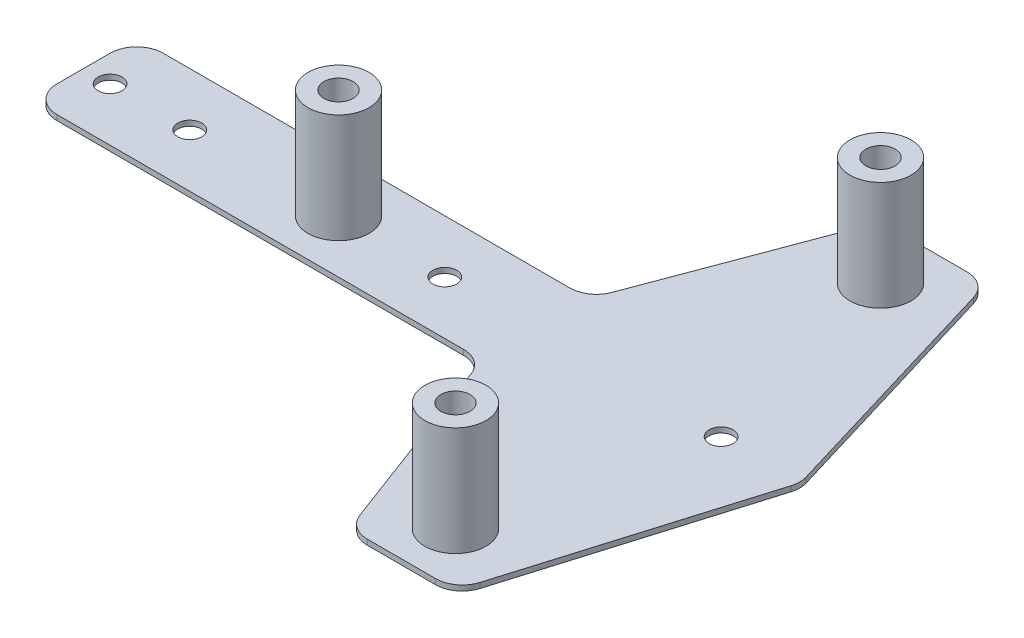
ISO-10303-21;
HEADER;
FILE_DESCRIPTION(('STEP AP214'),'2;1');
FILE_NAME('part.step','',(''),(''),'','','');
FILE_SCHEMA(('AUTOMOTIVE_DESIGN { 1 0 10303 214 1 1 1 1 }'));
ENDSEC;
DATA;
#1=APPLICATION_CONTEXT('core data for automotive mechanical design processes');
#2=APPLICATION_PROTOCOL_DEFINITION('international standard','automotive_design',2000,#1);
#3=PRODUCT_CONTEXT('',#1,'mechanical');
#4=PRODUCT('Part','Part','',(#3));
#5=PRODUCT_RELATED_PRODUCT_CATEGORY('part','',(#4));
#6=PRODUCT_DEFINITION_FORMATION('','',#4);
#7=PRODUCT_DEFINITION_CONTEXT('part definition',#1,'design');
#8=PRODUCT_DEFINITION('design','',#6,#7);
#9=PRODUCT_DEFINITION_SHAPE('','',#8);
#10=(LENGTH_UNIT() NAMED_UNIT(*) SI_UNIT(.MILLI.,.METRE.));
#11=(NAMED_UNIT(*) PLANE_ANGLE_UNIT() SI_UNIT($,.RADIAN.));
#12=(NAMED_UNIT(*) SI_UNIT($,.STERADIAN.) SOLID_ANGLE_UNIT());
#13=UNCERTAINTY_MEASURE_WITH_UNIT(LENGTH_MEASURE(1.E-05),#10,'distance_accuracy_value','');
#14=(GEOMETRIC_REPRESENTATION_CONTEXT(3) GLOBAL_UNCERTAINTY_ASSIGNED_CONTEXT((#13)) GLOBAL_UNIT_ASSIGNED_CONTEXT((#10,
#11,#12)) REPRESENTATION_CONTEXT('',''));
#15=CARTESIAN_POINT('',(0.,0.,0.));
#16=DIRECTION('',(0.,0.,1.));
#17=DIRECTION('',(1.,0.,0.));
#18=AXIS2_PLACEMENT_3D('',#15,#16,#17);
#19=CARTESIAN_POINT('',(-55.,0.,0.));
#20=DIRECTION('',(0.,1.,0.));
#21=DIRECTION('',(0.,0.,1.));
#22=AXIS2_PLACEMENT_3D('',#19,#20,#21);
#23=CYLINDRICAL_SURFACE('',#22,2.25);
#24=CARTESIAN_POINT('',(-55.,0.,0.));
#25=DIRECTION('',(0.,1.,0.));
#26=DIRECTION('',(0.,0.,1.));
#27=AXIS2_PLACEMENT_3D('',#24,#25,#26);
#28=CIRCLE('',#27,2.25);
#29=CARTESIAN_POINT('',(-55.,0.,2.25));
#30=VERTEX_POINT('',#29);
#31=EDGE_CURVE('E436',#30,#30,#28,.T.);
#32=ORIENTED_EDGE('',*,*,#31,.F.);
#33=EDGE_LOOP('',(#32));
#34=FACE_BOUND('',#33,.T.);
#35=CARTESIAN_POINT('',(-55.,1.,0.));
#36=DIRECTION('',(0.,1.,0.));
#37=DIRECTION('',(0.,0.,1.));
#38=AXIS2_PLACEMENT_3D('',#35,#36,#37);
#39=CIRCLE('',#38,2.25);
#40=CARTESIAN_POINT('',(-55.,1.,2.25));
#41=VERTEX_POINT('',#40);
#42=EDGE_CURVE('E439',#41,#41,#39,.T.);
#43=ORIENTED_EDGE('',*,*,#42,.T.);
#44=EDGE_LOOP('',(#43));
#45=FACE_BOUND('',#44,.T.);
#46=ADVANCED_FACE('F39',(#34,#45),#23,.F.);
#47=CARTESIAN_POINT('',(6.53499765917655,1.,-15.));
#48=DIRECTION('',(0.,1.,0.));
#49=DIRECTION('',(0.,0.,1.));
#50=AXIS2_PLACEMENT_3D('',#47,#48,#49);
#51=PLANE('',#50);
#52=ORIENTED_EDGE('',*,*,#42,.F.);
#53=EDGE_LOOP('',(#52));
#54=FACE_BOUND('',#53,.T.);
#55=DIRECTION('',(-1.,0.,0.));
#56=VECTOR('',#55,1.);
#57=CARTESIAN_POINT('',(-55.,1.,-10.));
#58=LINE('',#57,#56);
#59=CARTESIAN_POINT('',(6.53499765917655,1.,-10.));
#60=VERTEX_POINT('',#59);
#61=CARTESIAN_POINT('',(-70.,1.,-10.));
#62=VERTEX_POINT('',#61);
#63=EDGE_CURVE('E118',#60,#62,#58,.T.);
#64=ORIENTED_EDGE('',*,*,#63,.T.);
#65=CARTESIAN_POINT('',(-70.,1.,-5.00000000000001));
#66=DIRECTION('',(0.,1.,0.));
#67=DIRECTION('',(0.,0.,1.));
#68=AXIS2_PLACEMENT_3D('',#65,#66,#67);
#69=CIRCLE('',#68,5.);
#70=CARTESIAN_POINT('',(-75.,1.,-4.99999999999997));
#71=VERTEX_POINT('',#70);
#72=EDGE_CURVE('E474',#62,#71,#69,.T.);
#73=ORIENTED_EDGE('',*,*,#72,.T.);
#74=DIRECTION('',(0.,0.,1.));
#75=VECTOR('',#74,1.);
#76=CARTESIAN_POINT('',(-75.,1.,-4.99999999999997));
#77=LINE('',#76,#75);
#78=CARTESIAN_POINT('',(-75.,1.,4.99999999999997));
#79=VERTEX_POINT('',#78);
#80=EDGE_CURVE('E479',#71,#79,#77,.T.);
#81=ORIENTED_EDGE('',*,*,#80,.T.);
#82=CARTESIAN_POINT('',(-70.,1.,5.));
#83=DIRECTION('',(0.,1.,0.));
#84=DIRECTION('',(0.,0.,1.));
#85=AXIS2_PLACEMENT_3D('',#82,#83,#84);
#86=CIRCLE('',#85,5.);
#87=CARTESIAN_POINT('',(-70.,1.,10.));
#88=VERTEX_POINT('',#87);
#89=EDGE_CURVE('E408',#79,#88,#86,.T.);
#90=ORIENTED_EDGE('',*,*,#89,.T.);
#91=DIRECTION('',(1.,0.,0.));
#92=VECTOR('',#91,1.);
#93=CARTESIAN_POINT('',(6.53499765917655,1.,10.));
#94=LINE('',#93,#92);
#95=CARTESIAN_POINT('',(6.53499765917655,1.,10.));
#96=VERTEX_POINT('',#95);
#97=EDGE_CURVE('E404',#88,#96,#94,.T.);
#98=ORIENTED_EDGE('',*,*,#97,.T.);
#99=CARTESIAN_POINT('',(6.53499765917655,1.,15.));
#100=DIRECTION('',(0.,-1.,0.));
#101=DIRECTION('',(0.,0.,1.));
#102=AXIS2_PLACEMENT_3D('',#99,#100,#101);
#103=CIRCLE('',#102,5.);
#104=CARTESIAN_POINT('',(11.2166435470218,1.,13.244382792058));
#105=VERTEX_POINT('',#104);
#106=EDGE_CURVE('E241',#96,#105,#103,.T.);
#107=ORIENTED_EDGE('',*,*,#106,.T.);
#108=DIRECTION('',(0.351123441588391,0.,0.936329177569045));
#109=VECTOR('',#108,1.);
#110=CARTESIAN_POINT('',(23.7833564529782,1.,46.755617207942));
#111=LINE('',#110,#109);
#112=CARTESIAN_POINT('',(23.7833564529782,1.,46.755617207942));
#113=VERTEX_POINT('',#112);
#114=EDGE_CURVE('E266',#105,#113,#111,.T.);
#115=ORIENTED_EDGE('',*,*,#114,.T.);
#116=CARTESIAN_POINT('',(28.4650023408235,1.,45.));
#117=DIRECTION('',(0.,1.,0.));
#118=DIRECTION('',(0.,0.,-1.));
#119=AXIS2_PLACEMENT_3D('',#116,#117,#118);
#120=CIRCLE('',#119,4.99999999999999);
#121=CARTESIAN_POINT('',(28.4650023408235,1.,50.));
#122=VERTEX_POINT('',#121);
#123=EDGE_CURVE('E263',#113,#122,#120,.T.);
#124=ORIENTED_EDGE('',*,*,#123,.T.);
#125=DIRECTION('',(1.,0.,0.));
#126=VECTOR('',#125,1.);
#127=CARTESIAN_POINT('',(41.2798467455448,1.,50.));
#128=LINE('',#127,#126);
#129=CARTESIAN_POINT('',(41.2798467455448,1.,50.));
#130=VERTEX_POINT('',#129);
#131=EDGE_CURVE('E265',#122,#130,#128,.T.);
#132=ORIENTED_EDGE('',*,*,#131,.T.);
#133=CARTESIAN_POINT('',(41.2798467455448,1.,45.));
#134=DIRECTION('',(0.,1.,0.));
#135=DIRECTION('',(0.,0.,-1.));
#136=AXIS2_PLACEMENT_3D('',#133,#134,#135);
#137=CIRCLE('',#136,4.99999999999999);
#138=CARTESIAN_POINT('',(46.0689781716505,1.,46.4367394278317));
#139=VERTEX_POINT('',#138);
#140=EDGE_CURVE('E268',#130,#139,#137,.T.);
#141=ORIENTED_EDGE('',*,*,#140,.T.);
#142=DIRECTION('',(0.287347885566344,0.,-0.957826285221152));
#143=VECTOR('',#142,1.);
#144=CARTESIAN_POINT('',(59.5689781716505,1.,1.43673942783172));
#145=LINE('',#144,#143);
#146=CARTESIAN_POINT('',(59.5689781716505,1.,1.43673942783172));
#147=VERTEX_POINT('',#146);
#148=EDGE_CURVE('E274',#139,#147,#145,.T.);
#149=ORIENTED_EDGE('',*,*,#148,.T.);
#150=CARTESIAN_POINT('',(54.7798467455447,1.,0.));
#151=DIRECTION('',(0.,1.,0.));
#152=DIRECTION('',(0.,0.,-1.));
#153=AXIS2_PLACEMENT_3D('',#150,#151,#152);
#154=CIRCLE('',#153,5.00000000000001);
#155=CARTESIAN_POINT('',(59.5689781716505,1.,-1.43673942783172));
#156=VERTEX_POINT('',#155);
#157=EDGE_CURVE('E276',#147,#156,#154,.T.);
#158=ORIENTED_EDGE('',*,*,#157,.T.);
#159=DIRECTION('',(-0.287347885566344,0.,-0.957826285221152));
#160=VECTOR('',#159,1.);
#161=CARTESIAN_POINT('',(46.0689781716505,1.,-46.4367394278317));
#162=LINE('',#161,#160);
#163=CARTESIAN_POINT('',(46.0689781716505,1.,-46.4367394278317));
#164=VERTEX_POINT('',#163);
#165=EDGE_CURVE('E278',#156,#164,#162,.T.);
#166=ORIENTED_EDGE('',*,*,#165,.T.);
#167=CARTESIAN_POINT('',(41.2798467455448,1.,-45.));
#168=DIRECTION('',(0.,1.,0.));
#169=DIRECTION('',(0.,0.,-1.));
#170=AXIS2_PLACEMENT_3D('',#167,#168,#169);
#171=CIRCLE('',#170,4.99999999999999);
#172=CARTESIAN_POINT('',(41.2798467455448,1.,-50.));
#173=VERTEX_POINT('',#172);
#174=EDGE_CURVE('E159',#164,#173,#171,.T.);
#175=ORIENTED_EDGE('',*,*,#174,.T.);
#176=DIRECTION('',(-1.,0.,0.));
#177=VECTOR('',#176,1.);
#178=CARTESIAN_POINT('',(28.4650023408235,1.,-50.));
#179=LINE('',#178,#177);
#180=CARTESIAN_POINT('',(28.4650023408235,1.,-50.));
#181=VERTEX_POINT('',#180);
#182=EDGE_CURVE('E152',#173,#181,#179,.T.);
#183=ORIENTED_EDGE('',*,*,#182,.T.);
#184=CARTESIAN_POINT('',(28.4650023408235,1.,-45.));
#185=DIRECTION('',(0.,1.,0.));
#186=DIRECTION('',(0.,0.,-1.));
#187=AXIS2_PLACEMENT_3D('',#184,#185,#186);
#188=CIRCLE('',#187,4.99999999999999);
#189=CARTESIAN_POINT('',(23.7833564529782,1.,-46.755617207942));
#190=VERTEX_POINT('',#189);
#191=EDGE_CURVE('E157',#181,#190,#188,.T.);
#192=ORIENTED_EDGE('',*,*,#191,.T.);
#193=DIRECTION('',(-0.351123441588391,0.,0.936329177569045));
#194=VECTOR('',#193,1.);
#195=CARTESIAN_POINT('',(11.2166435470218,1.,-13.244382792058));
#196=LINE('',#195,#194);
#197=CARTESIAN_POINT('',(11.2166435470218,1.,-13.244382792058));
#198=VERTEX_POINT('',#197);
#199=EDGE_CURVE('E56',#190,#198,#196,.T.);
#200=ORIENTED_EDGE('',*,*,#199,.T.);
#201=CARTESIAN_POINT('',(6.53499765917655,1.,-15.));
#202=DIRECTION('',(0.,-1.,0.));
#203=DIRECTION('',(0.,0.,1.));
#204=AXIS2_PLACEMENT_3D('',#201,#202,#203);
#205=CIRCLE('',#204,5.);
#206=EDGE_CURVE('E207',#198,#60,#205,.T.);
#207=ORIENTED_EDGE('',*,*,#206,.T.);
#208=EDGE_LOOP('',(#64,#73,#81,#90,#98,#107,#115,#124,#132,#141,#149,#158,#166,#175,#183,#192,
#200,#207));
#209=FACE_BOUND('',#208,.T.);
#210=CARTESIAN_POINT('',(-70.,1.,0.));
#211=DIRECTION('',(0.,1.,0.));
#212=DIRECTION('',(0.,0.,1.));
#213=AXIS2_PLACEMENT_3D('',#210,#211,#212);
#214=CIRCLE('',#213,2.25);
#215=CARTESIAN_POINT('',(-70.,1.,2.24999999999999));
#216=VERTEX_POINT('',#215);
#217=EDGE_CURVE('E433',#216,#216,#214,.T.);
#218=ORIENTED_EDGE('',*,*,#217,.F.);
#219=EDGE_LOOP('',(#218));
#220=FACE_BOUND('',#219,.T.);
#221=CARTESIAN_POINT('',(45.,1.,0.));
#222=DIRECTION('',(0.,1.,0.));
#223=DIRECTION('',(0.,0.,1.));
#224=AXIS2_PLACEMENT_3D('',#221,#222,#223);
#225=CIRCLE('',#224,2.25);
#226=CARTESIAN_POINT('',(45.,1.,2.25));
#227=VERTEX_POINT('',#226);
#228=EDGE_CURVE('E442',#227,#227,#225,.T.);
#229=ORIENTED_EDGE('',*,*,#228,.F.);
#230=EDGE_LOOP('',(#229));
#231=FACE_BOUND('',#230,.T.);
#232=CARTESIAN_POINT('',(-7.,1.,0.));
#233=DIRECTION('',(0.,1.,0.));
#234=DIRECTION('',(0.,0.,1.));
#235=AXIS2_PLACEMENT_3D('',#232,#233,#234);
#236=CIRCLE('',#235,2.25);
#237=CARTESIAN_POINT('',(-7.,1.,2.25));
#238=VERTEX_POINT('',#237);
#239=EDGE_CURVE('E448',#238,#238,#236,.T.);
#240=ORIENTED_EDGE('',*,*,#239,.F.);
#241=EDGE_LOOP('',(#240));
#242=FACE_BOUND('',#241,.T.);
#243=CARTESIAN_POINT('',(35.,1.,-40.));
#244=DIRECTION('',(0.,1.,0.));
#245=DIRECTION('',(0.,0.,1.));
#246=AXIS2_PLACEMENT_3D('',#243,#244,#245);
#247=CIRCLE('',#246,5.74999999999999);
#248=CARTESIAN_POINT('',(35.,1.,-34.25));
#249=VERTEX_POINT('',#248);
#250=EDGE_CURVE('E375',#249,#249,#247,.T.);
#251=ORIENTED_EDGE('',*,*,#250,.F.);
#252=EDGE_LOOP('',(#251));
#253=FACE_BOUND('',#252,.T.);
#254=CARTESIAN_POINT('',(-27.,1.,0.));
#255=DIRECTION('',(0.,1.,0.));
#256=DIRECTION('',(0.,0.,1.));
#257=AXIS2_PLACEMENT_3D('',#254,#255,#256);
#258=CIRCLE('',#257,5.75);
#259=CARTESIAN_POINT('',(-27.,1.,5.75));
#260=VERTEX_POINT('',#259);
#261=EDGE_CURVE('E390',#260,#260,#258,.T.);
#262=ORIENTED_EDGE('',*,*,#261,.F.);
#263=EDGE_LOOP('',(#262));
#264=FACE_BOUND('',#263,.T.);
#265=CARTESIAN_POINT('',(35.,1.,40.));
#266=DIRECTION('',(0.,1.,0.));
#267=DIRECTION('',(0.,0.,1.));
#268=AXIS2_PLACEMENT_3D('',#265,#266,#267);
#269=CIRCLE('',#268,5.74999999999999);
#270=CARTESIAN_POINT('',(35.,1.,45.75));
#271=VERTEX_POINT('',#270);
#272=EDGE_CURVE('E372',#271,#271,#269,.T.);
#273=ORIENTED_EDGE('',*,*,#272,.F.);
#274=EDGE_LOOP('',(#273));
#275=FACE_BOUND('',#274,.T.);
#276=ADVANCED_FACE('F154',(#54,#209,#220,#231,#242,#253,#264,#275),#51,.T.);
#277=CARTESIAN_POINT('',(6.53499765917655,1.,-15.));
#278=DIRECTION('',(0.,-1.,0.));
#279=DIRECTION('',(0.,0.,-1.));
#280=AXIS2_PLACEMENT_3D('',#277,#278,#279);
#281=CYLINDRICAL_SURFACE('',#280,5.);
#282=CARTESIAN_POINT('',(6.53499765917655,0.,-15.));
#283=DIRECTION('',(0.,-1.,0.));
#284=DIRECTION('',(0.,0.,1.));
#285=AXIS2_PLACEMENT_3D('',#282,#283,#284);
#286=CIRCLE('',#285,5.);
#287=CARTESIAN_POINT('',(11.2166435470218,0.,-13.244382792058));
#288=VERTEX_POINT('',#287);
#289=CARTESIAN_POINT('',(6.53499765917655,0.,-10.));
#290=VERTEX_POINT('',#289);
#291=EDGE_CURVE('E177',#288,#290,#286,.T.);
#292=ORIENTED_EDGE('',*,*,#291,.T.);
#293=DIRECTION('',(0.,-1.,0.));
#294=VECTOR('',#293,1.);
#295=CARTESIAN_POINT('',(6.53499765917655,1.,-10.));
#296=LINE('',#295,#294);
#297=EDGE_CURVE('E11',#60,#290,#296,.T.);
#298=ORIENTED_EDGE('',*,*,#297,.F.);
#299=ORIENTED_EDGE('',*,*,#206,.F.);
#300=DIRECTION('',(0.,-1.,0.));
#301=VECTOR('',#300,1.);
#302=CARTESIAN_POINT('',(11.2166435470218,1.,-13.244382792058));
#303=LINE('',#302,#301);
#304=EDGE_CURVE('E173',#198,#288,#303,.T.);
#305=ORIENTED_EDGE('',*,*,#304,.T.);
#306=EDGE_LOOP('',(#292,#298,#299,#305));
#307=FACE_BOUND('',#306,.T.);
#308=ADVANCED_FACE('F41',(#307),#281,.F.);
#309=CARTESIAN_POINT('',(-55.,1.,-10.));
#310=DIRECTION('',(0.,0.,1.));
#311=DIRECTION('',(1.,0.,0.));
#312=AXIS2_PLACEMENT_3D('',#309,#310,#311);
#313=PLANE('',#312);
#314=DIRECTION('',(-1.,0.,0.));
#315=VECTOR('',#314,1.);
#316=CARTESIAN_POINT('',(-55.,0.,-10.));
#317=LINE('',#316,#315);
#318=CARTESIAN_POINT('',(-70.,0.,-10.));
#319=VERTEX_POINT('',#318);
#320=EDGE_CURVE('E180',#290,#319,#317,.T.);
#321=ORIENTED_EDGE('',*,*,#320,.T.);
#322=DIRECTION('',(0.,-1.,0.));
#323=VECTOR('',#322,1.);
#324=CARTESIAN_POINT('',(-70.,29.2842712474619,-10.));
#325=LINE('',#324,#323);
#326=EDGE_CURVE('E429',#62,#319,#325,.T.);
#327=ORIENTED_EDGE('',*,*,#326,.F.);
#328=ORIENTED_EDGE('',*,*,#63,.F.);
#329=ORIENTED_EDGE('',*,*,#297,.T.);
#330=EDGE_LOOP('',(#321,#327,#328,#329));
#331=FACE_BOUND('',#330,.T.);
#332=ADVANCED_FACE('F500',(#331),#313,.F.);
#333=CARTESIAN_POINT('',(6.53499765917655,1.,10.));
#334=DIRECTION('',(0.,0.,-1.));
#335=DIRECTION('',(-1.,0.,0.));
#336=AXIS2_PLACEMENT_3D('',#333,#334,#335);
#337=PLANE('',#336);
#338=DIRECTION('',(1.,0.,0.));
#339=VECTOR('',#338,1.);
#340=CARTESIAN_POINT('',(6.53499765917655,0.,10.));
#341=LINE('',#340,#339);
#342=CARTESIAN_POINT('',(-70.,0.,10.));
#343=VERTEX_POINT('',#342);
#344=CARTESIAN_POINT('',(6.53499765917655,0.,10.));
#345=VERTEX_POINT('',#344);
#346=EDGE_CURVE('E184',#343,#345,#341,.T.);
#347=ORIENTED_EDGE('',*,*,#346,.T.);
#348=DIRECTION('',(0.,-1.,0.));
#349=VECTOR('',#348,1.);
#350=CARTESIAN_POINT('',(6.53499765917655,1.,10.));
#351=LINE('',#350,#349);
#352=EDGE_CURVE('E48',#96,#345,#351,.T.);
#353=ORIENTED_EDGE('',*,*,#352,.F.);
#354=ORIENTED_EDGE('',*,*,#97,.F.);
#355=DIRECTION('',(0.,-1.,0.));
#356=VECTOR('',#355,1.);
#357=CARTESIAN_POINT('',(-70.,29.2842712474619,10.));
#358=LINE('',#357,#356);
#359=EDGE_CURVE('E411',#88,#343,#358,.T.);
#360=ORIENTED_EDGE('',*,*,#359,.T.);
#361=EDGE_LOOP('',(#347,#353,#354,#360));
#362=FACE_BOUND('',#361,.T.);
#363=ADVANCED_FACE('F410',(#362),#337,.F.);
#364=CARTESIAN_POINT('',(6.53499765917655,1.,15.));
#365=DIRECTION('',(0.,-1.,0.));
#366=DIRECTION('',(0.,0.,-1.));
#367=AXIS2_PLACEMENT_3D('',#364,#365,#366);
#368=CYLINDRICAL_SURFACE('',#367,5.);
#369=CARTESIAN_POINT('',(6.53499765917655,0.,15.));
#370=DIRECTION('',(0.,-1.,0.));
#371=DIRECTION('',(0.,0.,1.));
#372=AXIS2_PLACEMENT_3D('',#369,#370,#371);
#373=CIRCLE('',#372,5.);
#374=CARTESIAN_POINT('',(11.2166435470218,0.,13.244382792058));
#375=VERTEX_POINT('',#374);
#376=EDGE_CURVE('E186',#345,#375,#373,.T.);
#377=ORIENTED_EDGE('',*,*,#376,.T.);
#378=DIRECTION('',(0.,-1.,0.));
#379=VECTOR('',#378,1.);
#380=CARTESIAN_POINT('',(11.2166435470218,1.,13.244382792058));
#381=LINE('',#380,#379);
#382=EDGE_CURVE('E232',#105,#375,#381,.T.);
#383=ORIENTED_EDGE('',*,*,#382,.F.);
#384=ORIENTED_EDGE('',*,*,#106,.F.);
#385=ORIENTED_EDGE('',*,*,#352,.T.);
#386=EDGE_LOOP('',(#377,#383,#384,#385));
#387=FACE_BOUND('',#386,.T.);
#388=ADVANCED_FACE('F239',(#387),#368,.F.);
#389=CARTESIAN_POINT('',(23.7833564529782,1.,46.755617207942));
#390=DIRECTION('',(0.936329177569045,0.,-0.351123441588391));
#391=DIRECTION('',(-0.351123441588391,0.,-0.936329177569045));
#392=AXIS2_PLACEMENT_3D('',#389,#390,#391);
#393=PLANE('',#392);
#394=DIRECTION('',(0.351123441588391,0.,0.936329177569045));
#395=VECTOR('',#394,1.);
#396=CARTESIAN_POINT('',(23.7833564529782,0.,46.755617207942));
#397=LINE('',#396,#395);
#398=CARTESIAN_POINT('',(23.7833564529782,0.,46.755617207942));
#399=VERTEX_POINT('',#398);
#400=EDGE_CURVE('E188',#375,#399,#397,.T.);
#401=ORIENTED_EDGE('',*,*,#400,.T.);
#402=DIRECTION('',(0.,-1.,0.));
#403=VECTOR('',#402,1.);
#404=CARTESIAN_POINT('',(23.7833564529782,1.,46.755617207942));
#405=LINE('',#404,#403);
#406=EDGE_CURVE('E229',#113,#399,#405,.T.);
#407=ORIENTED_EDGE('',*,*,#406,.F.);
#408=ORIENTED_EDGE('',*,*,#114,.F.);
#409=ORIENTED_EDGE('',*,*,#382,.T.);
#410=EDGE_LOOP('',(#401,#407,#408,#409));
#411=FACE_BOUND('',#410,.T.);
#412=ADVANCED_FACE('F257',(#411),#393,.F.);
#413=CARTESIAN_POINT('',(28.4650023408235,1.,45.));
#414=DIRECTION('',(0.,-1.,0.));
#415=DIRECTION('',(0.,0.,-1.));
#416=AXIS2_PLACEMENT_3D('',#413,#414,#415);
#417=CYLINDRICAL_SURFACE('',#416,4.99999999999999);
#418=CARTESIAN_POINT('',(28.4650023408235,0.,45.));
#419=DIRECTION('',(0.,1.,0.));
#420=DIRECTION('',(0.,0.,-1.));
#421=AXIS2_PLACEMENT_3D('',#418,#419,#420);
#422=CIRCLE('',#421,4.99999999999999);
#423=CARTESIAN_POINT('',(28.4650023408235,0.,50.));
#424=VERTEX_POINT('',#423);
#425=EDGE_CURVE('E190',#399,#424,#422,.T.);
#426=ORIENTED_EDGE('',*,*,#425,.T.);
#427=DIRECTION('',(0.,-1.,0.));
#428=VECTOR('',#427,1.);
#429=CARTESIAN_POINT('',(28.4650023408235,1.,50.));
#430=LINE('',#429,#428);
#431=EDGE_CURVE('E226',#122,#424,#430,.T.);
#432=ORIENTED_EDGE('',*,*,#431,.F.);
#433=ORIENTED_EDGE('',*,*,#123,.F.);
#434=ORIENTED_EDGE('',*,*,#406,.T.);
#435=EDGE_LOOP('',(#426,#432,#433,#434));
#436=FACE_BOUND('',#435,.T.);
#437=ADVANCED_FACE('F261',(#436),#417,.T.);
#438=CARTESIAN_POINT('',(41.2798467455448,1.,50.));
#439=DIRECTION('',(0.,0.,-1.));
#440=DIRECTION('',(-1.,0.,0.));
#441=AXIS2_PLACEMENT_3D('',#438,#439,#440);
#442=PLANE('',#441);
#443=DIRECTION('',(1.,0.,0.));
#444=VECTOR('',#443,1.);
#445=CARTESIAN_POINT('',(41.2798467455448,0.,50.));
#446=LINE('',#445,#444);
#447=CARTESIAN_POINT('',(41.2798467455448,0.,50.));
#448=VERTEX_POINT('',#447);
#449=EDGE_CURVE('E192',#424,#448,#446,.T.);
#450=ORIENTED_EDGE('',*,*,#449,.T.);
#451=DIRECTION('',(0.,-1.,0.));
#452=VECTOR('',#451,1.);
#453=CARTESIAN_POINT('',(41.2798467455448,1.,50.));
#454=LINE('',#453,#452);
#455=EDGE_CURVE('E223',#130,#448,#454,.T.);
#456=ORIENTED_EDGE('',*,*,#455,.F.);
#457=ORIENTED_EDGE('',*,*,#131,.F.);
#458=ORIENTED_EDGE('',*,*,#431,.T.);
#459=EDGE_LOOP('',(#450,#456,#457,#458));
#460=FACE_BOUND('',#459,.T.);
#461=ADVANCED_FACE('F514',(#460),#442,.F.);
#462=CARTESIAN_POINT('',(41.2798467455448,1.,45.));
#463=DIRECTION('',(0.,-1.,0.));
#464=DIRECTION('',(0.,0.,-1.));
#465=AXIS2_PLACEMENT_3D('',#462,#463,#464);
#466=CYLINDRICAL_SURFACE('',#465,4.99999999999999);
#467=CARTESIAN_POINT('',(41.2798467455448,0.,45.));
#468=DIRECTION('',(0.,1.,0.));
#469=DIRECTION('',(0.,0.,-1.));
#470=AXIS2_PLACEMENT_3D('',#467,#468,#469);
#471=CIRCLE('',#470,4.99999999999999);
#472=CARTESIAN_POINT('',(46.0689781716505,0.,46.4367394278317));
#473=VERTEX_POINT('',#472);
#474=EDGE_CURVE('E194',#448,#473,#471,.T.);
#475=ORIENTED_EDGE('',*,*,#474,.T.);
#476=DIRECTION('',(0.,-1.,0.));
#477=VECTOR('',#476,1.);
#478=CARTESIAN_POINT('',(46.0689781716505,1.,46.4367394278317));
#479=LINE('',#478,#477);
#480=EDGE_CURVE('E220',#139,#473,#479,.T.);
#481=ORIENTED_EDGE('',*,*,#480,.F.);
#482=ORIENTED_EDGE('',*,*,#140,.F.);
#483=ORIENTED_EDGE('',*,*,#455,.T.);
#484=EDGE_LOOP('',(#475,#481,#482,#483));
#485=FACE_BOUND('',#484,.T.);
#486=ADVANCED_FACE('F517',(#485),#466,.T.);
#487=CARTESIAN_POINT('',(59.5689781716505,1.,1.43673942783172));
#488=DIRECTION('',(-0.957826285221152,0.,-0.287347885566344));
#489=DIRECTION('',(-0.287347885566344,0.,0.957826285221152));
#490=AXIS2_PLACEMENT_3D('',#487,#488,#489);
#491=PLANE('',#490);
#492=DIRECTION('',(0.287347885566344,0.,-0.957826285221152));
#493=VECTOR('',#492,1.);
#494=CARTESIAN_POINT('',(59.5689781716505,0.,1.43673942783172));
#495=LINE('',#494,#493);
#496=CARTESIAN_POINT('',(59.5689781716505,0.,1.43673942783172));
#497=VERTEX_POINT('',#496);
#498=EDGE_CURVE('E196',#473,#497,#495,.T.);
#499=ORIENTED_EDGE('',*,*,#498,.T.);
#500=DIRECTION('',(0.,-1.,0.));
#501=VECTOR('',#500,1.);
#502=CARTESIAN_POINT('',(59.5689781716505,1.,1.43673942783172));
#503=LINE('',#502,#501);
#504=EDGE_CURVE('E217',#147,#497,#503,.T.);
#505=ORIENTED_EDGE('',*,*,#504,.F.);
#506=ORIENTED_EDGE('',*,*,#148,.F.);
#507=ORIENTED_EDGE('',*,*,#480,.T.);
#508=EDGE_LOOP('',(#499,#505,#506,#507));
#509=FACE_BOUND('',#508,.T.);
#510=ADVANCED_FACE('F521',(#509),#491,.F.);
#511=CARTESIAN_POINT('',(54.7798467455447,1.,0.));
#512=DIRECTION('',(0.,-1.,0.));
#513=DIRECTION('',(0.,0.,-1.));
#514=AXIS2_PLACEMENT_3D('',#511,#512,#513);
#515=CYLINDRICAL_SURFACE('',#514,5.00000000000001);
#516=CARTESIAN_POINT('',(54.7798467455447,0.,0.));
#517=DIRECTION('',(0.,1.,0.));
#518=DIRECTION('',(0.,0.,-1.));
#519=AXIS2_PLACEMENT_3D('',#516,#517,#518);
#520=CIRCLE('',#519,5.00000000000001);
#521=CARTESIAN_POINT('',(59.5689781716505,0.,-1.43673942783172));
#522=VERTEX_POINT('',#521);
#523=EDGE_CURVE('E198',#497,#522,#520,.T.);
#524=ORIENTED_EDGE('',*,*,#523,.T.);
#525=DIRECTION('',(0.,-1.,0.));
#526=VECTOR('',#525,1.);
#527=CARTESIAN_POINT('',(59.5689781716505,1.,-1.43673942783172));
#528=LINE('',#527,#526);
#529=EDGE_CURVE('E214',#156,#522,#528,.T.);
#530=ORIENTED_EDGE('',*,*,#529,.F.);
#531=ORIENTED_EDGE('',*,*,#157,.F.);
#532=ORIENTED_EDGE('',*,*,#504,.T.);
#533=EDGE_LOOP('',(#524,#530,#531,#532));
#534=FACE_BOUND('',#533,.T.);
#535=ADVANCED_FACE('F525',(#534),#515,.T.);
#536=CARTESIAN_POINT('',(46.0689781716505,1.,-46.4367394278317));
#537=DIRECTION('',(-0.957826285221152,0.,0.287347885566344));
#538=DIRECTION('',(0.287347885566344,0.,0.957826285221152));
#539=AXIS2_PLACEMENT_3D('',#536,#537,#538);
#540=PLANE('',#539);
#541=DIRECTION('',(-0.287347885566344,0.,-0.957826285221152));
#542=VECTOR('',#541,1.);
#543=CARTESIAN_POINT('',(46.0689781716505,0.,-46.4367394278317));
#544=LINE('',#543,#542);
#545=CARTESIAN_POINT('',(46.0689781716505,0.,-46.4367394278317));
#546=VERTEX_POINT('',#545);
#547=EDGE_CURVE('E200',#522,#546,#544,.T.);
#548=ORIENTED_EDGE('',*,*,#547,.T.);
#549=DIRECTION('',(0.,-1.,0.));
#550=VECTOR('',#549,1.);
#551=CARTESIAN_POINT('',(46.0689781716505,1.,-46.4367394278317));
#552=LINE('',#551,#550);
#553=EDGE_CURVE('E211',#164,#546,#552,.T.);
#554=ORIENTED_EDGE('',*,*,#553,.F.);
#555=ORIENTED_EDGE('',*,*,#165,.F.);
#556=ORIENTED_EDGE('',*,*,#529,.T.);
#557=EDGE_LOOP('',(#548,#554,#555,#556));
#558=FACE_BOUND('',#557,.T.);
#559=ADVANCED_FACE('F284',(#558),#540,.F.);
#560=CARTESIAN_POINT('',(41.2798467455448,1.,-45.));
#561=DIRECTION('',(0.,-1.,0.));
#562=DIRECTION('',(0.,0.,-1.));
#563=AXIS2_PLACEMENT_3D('',#560,#561,#562);
#564=CYLINDRICAL_SURFACE('',#563,4.99999999999999);
#565=CARTESIAN_POINT('',(41.2798467455448,0.,-45.));
#566=DIRECTION('',(0.,1.,0.));
#567=DIRECTION('',(0.,0.,-1.));
#568=AXIS2_PLACEMENT_3D('',#565,#566,#567);
#569=CIRCLE('',#568,4.99999999999999);
#570=CARTESIAN_POINT('',(41.2798467455448,0.,-50.));
#571=VERTEX_POINT('',#570);
#572=EDGE_CURVE('E202',#546,#571,#569,.T.);
#573=ORIENTED_EDGE('',*,*,#572,.T.);
#574=DIRECTION('',(0.,-1.,0.));
#575=VECTOR('',#574,1.);
#576=CARTESIAN_POINT('',(41.2798467455448,1.,-50.));
#577=LINE('',#576,#575);
#578=EDGE_CURVE('E168',#173,#571,#577,.T.);
#579=ORIENTED_EDGE('',*,*,#578,.F.);
#580=ORIENTED_EDGE('',*,*,#174,.F.);
#581=ORIENTED_EDGE('',*,*,#553,.T.);
#582=EDGE_LOOP('',(#573,#579,#580,#581));
#583=FACE_BOUND('',#582,.T.);
#584=ADVANCED_FACE('F288',(#583),#564,.T.);
#585=CARTESIAN_POINT('',(28.4650023408235,1.,-50.));
#586=DIRECTION('',(0.,0.,1.));
#587=DIRECTION('',(1.,0.,0.));
#588=AXIS2_PLACEMENT_3D('',#585,#586,#587);
#589=PLANE('',#588);
#590=DIRECTION('',(-1.,0.,0.));
#591=VECTOR('',#590,1.);
#592=CARTESIAN_POINT('',(28.4650023408235,0.,-50.));
#593=LINE('',#592,#591);
#594=CARTESIAN_POINT('',(28.4650023408235,0.,-50.));
#595=VERTEX_POINT('',#594);
#596=EDGE_CURVE('E167',#571,#595,#593,.T.);
#597=ORIENTED_EDGE('',*,*,#596,.T.);
#598=DIRECTION('',(0.,-1.,0.));
#599=VECTOR('',#598,1.);
#600=CARTESIAN_POINT('',(28.4650023408235,1.,-50.));
#601=LINE('',#600,#599);
#602=EDGE_CURVE('E164',#181,#595,#601,.T.);
#603=ORIENTED_EDGE('',*,*,#602,.F.);
#604=ORIENTED_EDGE('',*,*,#182,.F.);
#605=ORIENTED_EDGE('',*,*,#578,.T.);
#606=EDGE_LOOP('',(#597,#603,#604,#605));
#607=FACE_BOUND('',#606,.T.);
#608=ADVANCED_FACE('F165',(#607),#589,.F.);
#609=CARTESIAN_POINT('',(28.4650023408235,1.,-45.));
#610=DIRECTION('',(0.,-1.,0.));
#611=DIRECTION('',(0.,0.,-1.));
#612=AXIS2_PLACEMENT_3D('',#609,#610,#611);
#613=CYLINDRICAL_SURFACE('',#612,4.99999999999999);
#614=CARTESIAN_POINT('',(28.4650023408235,0.,-45.));
#615=DIRECTION('',(0.,1.,0.));
#616=DIRECTION('',(0.,0.,-1.));
#617=AXIS2_PLACEMENT_3D('',#614,#615,#616);
#618=CIRCLE('',#617,4.99999999999999);
#619=CARTESIAN_POINT('',(23.7833564529782,0.,-46.755617207942));
#620=VERTEX_POINT('',#619);
#621=EDGE_CURVE('E104',#595,#620,#618,.T.);
#622=ORIENTED_EDGE('',*,*,#621,.T.);
#623=DIRECTION('',(0.,-1.,0.));
#624=VECTOR('',#623,1.);
#625=CARTESIAN_POINT('',(23.7833564529782,1.,-46.755617207942));
#626=LINE('',#625,#624);
#627=EDGE_CURVE('E169',#190,#620,#626,.T.);
#628=ORIENTED_EDGE('',*,*,#627,.F.);
#629=ORIENTED_EDGE('',*,*,#191,.F.);
#630=ORIENTED_EDGE('',*,*,#602,.T.);
#631=EDGE_LOOP('',(#622,#628,#629,#630));
#632=FACE_BOUND('',#631,.T.);
#633=ADVANCED_FACE('F171',(#632),#613,.T.);
#634=CARTESIAN_POINT('',(11.2166435470218,1.,-13.244382792058));
#635=DIRECTION('',(0.936329177569045,0.,0.351123441588391));
#636=DIRECTION('',(0.351123441588391,0.,-0.936329177569045));
#637=AXIS2_PLACEMENT_3D('',#634,#635,#636);
#638=PLANE('',#637);
#639=DIRECTION('',(-0.351123441588391,0.,0.936329177569045));
#640=VECTOR('',#639,1.);
#641=CARTESIAN_POINT('',(11.2166435470218,0.,-13.244382792058));
#642=LINE('',#641,#640);
#643=EDGE_CURVE('E110',#620,#288,#642,.T.);
#644=ORIENTED_EDGE('',*,*,#643,.T.);
#645=ORIENTED_EDGE('',*,*,#304,.F.);
#646=ORIENTED_EDGE('',*,*,#199,.F.);
#647=ORIENTED_EDGE('',*,*,#627,.T.);
#648=EDGE_LOOP('',(#644,#645,#646,#647));
#649=FACE_BOUND('',#648,.T.);
#650=ADVANCED_FACE('F293',(#649),#638,.F.);
#651=CARTESIAN_POINT('',(6.53499765917655,0.,-15.));
#652=DIRECTION('',(0.,1.,0.));
#653=DIRECTION('',(0.,0.,1.));
#654=AXIS2_PLACEMENT_3D('',#651,#652,#653);
#655=PLANE('',#654);
#656=ORIENTED_EDGE('',*,*,#31,.T.);
#657=EDGE_LOOP('',(#656));
#658=FACE_BOUND('',#657,.T.);
#659=CARTESIAN_POINT('',(-70.,0.,-5.00000000000001));
#660=DIRECTION('',(0.,1.,0.));
#661=DIRECTION('',(0.,0.,1.));
#662=AXIS2_PLACEMENT_3D('',#659,#660,#661);
#663=CIRCLE('',#662,5.);
#664=CARTESIAN_POINT('',(-75.,0.,-4.99999999999997));
#665=VERTEX_POINT('',#664);
#666=EDGE_CURVE('E473',#319,#665,#663,.T.);
#667=ORIENTED_EDGE('',*,*,#666,.F.);
#668=ORIENTED_EDGE('',*,*,#320,.F.);
#669=ORIENTED_EDGE('',*,*,#291,.F.);
#670=ORIENTED_EDGE('',*,*,#643,.F.);
#671=ORIENTED_EDGE('',*,*,#621,.F.);
#672=ORIENTED_EDGE('',*,*,#596,.F.);
#673=ORIENTED_EDGE('',*,*,#572,.F.);
#674=ORIENTED_EDGE('',*,*,#547,.F.);
#675=ORIENTED_EDGE('',*,*,#523,.F.);
#676=ORIENTED_EDGE('',*,*,#498,.F.);
#677=ORIENTED_EDGE('',*,*,#474,.F.);
#678=ORIENTED_EDGE('',*,*,#449,.F.);
#679=ORIENTED_EDGE('',*,*,#425,.F.);
#680=ORIENTED_EDGE('',*,*,#400,.F.);
#681=ORIENTED_EDGE('',*,*,#376,.F.);
#682=ORIENTED_EDGE('',*,*,#346,.F.);
#683=CARTESIAN_POINT('',(-70.,0.,5.));
#684=DIRECTION('',(0.,1.,0.));
#685=DIRECTION('',(0.,0.,-1.));
#686=AXIS2_PLACEMENT_3D('',#683,#684,#685);
#687=CIRCLE('',#686,5.);
#688=CARTESIAN_POINT('',(-75.,0.,4.99999999999997));
#689=VERTEX_POINT('',#688);
#690=EDGE_CURVE('E418',#689,#343,#687,.T.);
#691=ORIENTED_EDGE('',*,*,#690,.F.);
#692=DIRECTION('',(0.,0.,1.));
#693=VECTOR('',#692,1.);
#694=CARTESIAN_POINT('',(-75.,0.,-4.99999999999997));
#695=LINE('',#694,#693);
#696=EDGE_CURVE('E423',#665,#689,#695,.T.);
#697=ORIENTED_EDGE('',*,*,#696,.F.);
#698=EDGE_LOOP('',(#667,#668,#669,#670,#671,#672,#673,#674,#675,#676,#677,#678,#679,#680,#681,
#682,#691,#697));
#699=FACE_BOUND('',#698,.T.);
#700=CARTESIAN_POINT('',(35.,0.,40.));
#701=DIRECTION('',(0.,1.,0.));
#702=DIRECTION('',(0.,0.,1.));
#703=AXIS2_PLACEMENT_3D('',#700,#701,#702);
#704=CIRCLE('',#703,2.75);
#705=CARTESIAN_POINT('',(35.,0.,42.75));
#706=VERTEX_POINT('',#705);
#707=EDGE_CURVE('E366',#706,#706,#704,.T.);
#708=ORIENTED_EDGE('',*,*,#707,.T.);
#709=EDGE_LOOP('',(#708));
#710=FACE_BOUND('',#709,.T.);
#711=CARTESIAN_POINT('',(35.,0.,-40.));
#712=DIRECTION('',(0.,1.,0.));
#713=DIRECTION('',(0.,0.,1.));
#714=AXIS2_PLACEMENT_3D('',#711,#712,#713);
#715=CIRCLE('',#714,2.75);
#716=CARTESIAN_POINT('',(35.,0.,-37.25));
#717=VERTEX_POINT('',#716);
#718=EDGE_CURVE('E398',#717,#717,#715,.T.);
#719=ORIENTED_EDGE('',*,*,#718,.T.);
#720=EDGE_LOOP('',(#719));
#721=FACE_BOUND('',#720,.T.);
#722=CARTESIAN_POINT('',(-27.,0.,0.));
#723=DIRECTION('',(0.,1.,0.));
#724=DIRECTION('',(0.,0.,1.));
#725=AXIS2_PLACEMENT_3D('',#722,#723,#724);
#726=CIRCLE('',#725,2.75);
#727=CARTESIAN_POINT('',(-27.,0.,2.75));
#728=VERTEX_POINT('',#727);
#729=EDGE_CURVE('E181',#728,#728,#726,.T.);
#730=ORIENTED_EDGE('',*,*,#729,.T.);
#731=EDGE_LOOP('',(#730));
#732=FACE_BOUND('',#731,.T.);
#733=CARTESIAN_POINT('',(-7.,0.,0.));
#734=DIRECTION('',(0.,1.,0.));
#735=DIRECTION('',(0.,0.,1.));
#736=AXIS2_PLACEMENT_3D('',#733,#734,#735);
#737=CIRCLE('',#736,2.25);
#738=CARTESIAN_POINT('',(-7.,0.,2.25));
#739=VERTEX_POINT('',#738);
#740=EDGE_CURVE('E432',#739,#739,#737,.T.);
#741=ORIENTED_EDGE('',*,*,#740,.T.);
#742=EDGE_LOOP('',(#741));
#743=FACE_BOUND('',#742,.T.);
#744=CARTESIAN_POINT('',(45.,0.,0.));
#745=DIRECTION('',(0.,1.,0.));
#746=DIRECTION('',(0.,0.,1.));
#747=AXIS2_PLACEMENT_3D('',#744,#745,#746);
#748=CIRCLE('',#747,2.25);
#749=CARTESIAN_POINT('',(45.,0.,2.25));
#750=VERTEX_POINT('',#749);
#751=EDGE_CURVE('E445',#750,#750,#748,.T.);
#752=ORIENTED_EDGE('',*,*,#751,.T.);
#753=EDGE_LOOP('',(#752));
#754=FACE_BOUND('',#753,.T.);
#755=CARTESIAN_POINT('',(-70.,0.,0.));
#756=DIRECTION('',(0.,1.,0.));
#757=DIRECTION('',(0.,0.,1.));
#758=AXIS2_PLACEMENT_3D('',#755,#756,#757);
#759=CIRCLE('',#758,2.25);
#760=CARTESIAN_POINT('',(-70.,0.,2.24999999999999));
#761=VERTEX_POINT('',#760);
#762=EDGE_CURVE('E471',#761,#761,#759,.T.);
#763=ORIENTED_EDGE('',*,*,#762,.T.);
#764=EDGE_LOOP('',(#763));
#765=FACE_BOUND('',#764,.T.);
#766=ADVANCED_FACE('F248',(#658,#699,#710,#721,#732,#743,#754,#765),#655,.F.);
#767=CARTESIAN_POINT('',(35.,0.,40.));
#768=DIRECTION('',(0.,1.,0.));
#769=DIRECTION('',(0.,0.,1.));
#770=AXIS2_PLACEMENT_3D('',#767,#768,#769);
#771=CYLINDRICAL_SURFACE('',#770,2.75);
#772=ORIENTED_EDGE('',*,*,#707,.F.);
#773=EDGE_LOOP('',(#772));
#774=FACE_BOUND('',#773,.T.);
#775=CARTESIAN_POINT('',(35.,21.5,40.));
#776=DIRECTION('',(0.,1.,0.));
#777=DIRECTION('',(0.,0.,1.));
#778=AXIS2_PLACEMENT_3D('',#775,#776,#777);
#779=CIRCLE('',#778,2.74999999999999);
#780=CARTESIAN_POINT('',(35.,21.5,42.75));
#781=VERTEX_POINT('',#780);
#782=EDGE_CURVE('E369',#781,#781,#779,.T.);
#783=ORIENTED_EDGE('',*,*,#782,.T.);
#784=EDGE_LOOP('',(#783));
#785=FACE_BOUND('',#784,.T.);
#786=ADVANCED_FACE('F300',(#774,#785),#771,.F.);
#787=CARTESIAN_POINT('',(35.,0.,-40.));
#788=DIRECTION('',(0.,1.,0.));
#789=DIRECTION('',(0.,0.,1.));
#790=AXIS2_PLACEMENT_3D('',#787,#788,#789);
#791=CYLINDRICAL_SURFACE('',#790,2.75);
#792=ORIENTED_EDGE('',*,*,#718,.F.);
#793=EDGE_LOOP('',(#792));
#794=FACE_BOUND('',#793,.T.);
#795=CARTESIAN_POINT('',(35.,21.5,-40.));
#796=DIRECTION('',(0.,1.,0.));
#797=DIRECTION('',(0.,0.,1.));
#798=AXIS2_PLACEMENT_3D('',#795,#796,#797);
#799=CIRCLE('',#798,2.74999999999999);
#800=CARTESIAN_POINT('',(35.,21.5,-37.25));
#801=VERTEX_POINT('',#800);
#802=EDGE_CURVE('E383',#801,#801,#799,.T.);
#803=ORIENTED_EDGE('',*,*,#802,.T.);
#804=EDGE_LOOP('',(#803));
#805=FACE_BOUND('',#804,.T.);
#806=ADVANCED_FACE('F354',(#794,#805),#791,.F.);
#807=CARTESIAN_POINT('',(-27.,0.,0.));
#808=DIRECTION('',(0.,1.,0.));
#809=DIRECTION('',(0.,0.,1.));
#810=AXIS2_PLACEMENT_3D('',#807,#808,#809);
#811=CYLINDRICAL_SURFACE('',#810,2.75);
#812=ORIENTED_EDGE('',*,*,#729,.F.);
#813=EDGE_LOOP('',(#812));
#814=FACE_BOUND('',#813,.T.);
#815=CARTESIAN_POINT('',(-27.,21.5,0.));
#816=DIRECTION('',(0.,1.,0.));
#817=DIRECTION('',(0.,0.,1.));
#818=AXIS2_PLACEMENT_3D('',#815,#816,#817);
#819=CIRCLE('',#818,2.75);
#820=CARTESIAN_POINT('',(-27.,21.5,2.75));
#821=VERTEX_POINT('',#820);
#822=EDGE_CURVE('E387',#821,#821,#819,.T.);
#823=ORIENTED_EDGE('',*,*,#822,.T.);
#824=EDGE_LOOP('',(#823));
#825=FACE_BOUND('',#824,.T.);
#826=ADVANCED_FACE('F347',(#814,#825),#811,.F.);
#827=CARTESIAN_POINT('',(-27.,21.5,0.));
#828=DIRECTION('',(0.,1.,0.));
#829=DIRECTION('',(0.,0.,1.));
#830=AXIS2_PLACEMENT_3D('',#827,#828,#829);
#831=PLANE('',#830);
#832=CARTESIAN_POINT('',(-27.,21.5,0.));
#833=DIRECTION('',(0.,1.,0.));
#834=DIRECTION('',(0.,0.,1.));
#835=AXIS2_PLACEMENT_3D('',#832,#833,#834);
#836=CIRCLE('',#835,5.75);
#837=CARTESIAN_POINT('',(-27.,21.5,5.75));
#838=VERTEX_POINT('',#837);
#839=EDGE_CURVE('E391',#838,#838,#836,.T.);
#840=ORIENTED_EDGE('',*,*,#839,.T.);
#841=EDGE_LOOP('',(#840));
#842=FACE_BOUND('',#841,.T.);
#843=ORIENTED_EDGE('',*,*,#822,.F.);
#844=EDGE_LOOP('',(#843));
#845=FACE_BOUND('',#844,.T.);
#846=ADVANCED_FACE('F344',(#842,#845),#831,.T.);
#847=CARTESIAN_POINT('',(-27.,21.5,0.));
#848=DIRECTION('',(0.,-1.,0.));
#849=DIRECTION('',(0.,0.,-1.));
#850=AXIS2_PLACEMENT_3D('',#847,#848,#849);
#851=CYLINDRICAL_SURFACE('',#850,5.75);
#852=ORIENTED_EDGE('',*,*,#839,.F.);
#853=EDGE_LOOP('',(#852));
#854=FACE_BOUND('',#853,.T.);
#855=ORIENTED_EDGE('',*,*,#261,.T.);
#856=EDGE_LOOP('',(#855));
#857=FACE_BOUND('',#856,.T.);
#858=ADVANCED_FACE('F342',(#854,#857),#851,.T.);
#859=CARTESIAN_POINT('',(35.,21.5,-40.));
#860=DIRECTION('',(0.,1.,0.));
#861=DIRECTION('',(0.,0.,1.));
#862=AXIS2_PLACEMENT_3D('',#859,#860,#861);
#863=PLANE('',#862);
#864=CARTESIAN_POINT('',(35.,21.5,-40.));
#865=DIRECTION('',(0.,1.,0.));
#866=DIRECTION('',(0.,0.,1.));
#867=AXIS2_PLACEMENT_3D('',#864,#865,#866);
#868=CIRCLE('',#867,5.74999999999999);
#869=CARTESIAN_POINT('',(35.,21.5,-34.25));
#870=VERTEX_POINT('',#869);
#871=EDGE_CURVE('E371',#870,#870,#868,.T.);
#872=ORIENTED_EDGE('',*,*,#871,.T.);
#873=EDGE_LOOP('',(#872));
#874=FACE_BOUND('',#873,.T.);
#875=ORIENTED_EDGE('',*,*,#802,.F.);
#876=EDGE_LOOP('',(#875));
#877=FACE_BOUND('',#876,.T.);
#878=ADVANCED_FACE('F338',(#874,#877),#863,.T.);
#879=CARTESIAN_POINT('',(35.,21.5,-40.));
#880=DIRECTION('',(0.,-1.,0.));
#881=DIRECTION('',(0.,0.,-1.));
#882=AXIS2_PLACEMENT_3D('',#879,#880,#881);
#883=CYLINDRICAL_SURFACE('',#882,5.74999999999999);
#884=ORIENTED_EDGE('',*,*,#871,.F.);
#885=EDGE_LOOP('',(#884));
#886=FACE_BOUND('',#885,.T.);
#887=ORIENTED_EDGE('',*,*,#250,.T.);
#888=EDGE_LOOP('',(#887));
#889=FACE_BOUND('',#888,.T.);
#890=ADVANCED_FACE('F334',(#886,#889),#883,.T.);
#891=CARTESIAN_POINT('',(35.,21.5,40.));
#892=DIRECTION('',(0.,1.,0.));
#893=DIRECTION('',(0.,0.,1.));
#894=AXIS2_PLACEMENT_3D('',#891,#892,#893);
#895=PLANE('',#894);
#896=CARTESIAN_POINT('',(35.,21.5,40.));
#897=DIRECTION('',(0.,1.,0.));
#898=DIRECTION('',(0.,0.,1.));
#899=AXIS2_PLACEMENT_3D('',#896,#897,#898);
#900=CIRCLE('',#899,5.74999999999999);
#901=CARTESIAN_POINT('',(35.,21.5,45.75));
#902=VERTEX_POINT('',#901);
#903=EDGE_CURVE('E378',#902,#902,#900,.T.);
#904=ORIENTED_EDGE('',*,*,#903,.T.);
#905=EDGE_LOOP('',(#904));
#906=FACE_BOUND('',#905,.T.);
#907=ORIENTED_EDGE('',*,*,#782,.F.);
#908=EDGE_LOOP('',(#907));
#909=FACE_BOUND('',#908,.T.);
#910=ADVANCED_FACE('F330',(#906,#909),#895,.T.);
#911=CARTESIAN_POINT('',(35.,21.5,40.));
#912=DIRECTION('',(0.,-1.,0.));
#913=DIRECTION('',(0.,0.,-1.));
#914=AXIS2_PLACEMENT_3D('',#911,#912,#913);
#915=CYLINDRICAL_SURFACE('',#914,5.74999999999999);
#916=ORIENTED_EDGE('',*,*,#903,.F.);
#917=EDGE_LOOP('',(#916));
#918=FACE_BOUND('',#917,.T.);
#919=ORIENTED_EDGE('',*,*,#272,.T.);
#920=EDGE_LOOP('',(#919));
#921=FACE_BOUND('',#920,.T.);
#922=ADVANCED_FACE('F326',(#918,#921),#915,.T.);
#923=CARTESIAN_POINT('',(-7.,0.,0.));
#924=DIRECTION('',(0.,1.,0.));
#925=DIRECTION('',(0.,0.,1.));
#926=AXIS2_PLACEMENT_3D('',#923,#924,#925);
#927=CYLINDRICAL_SURFACE('',#926,2.25);
#928=ORIENTED_EDGE('',*,*,#740,.F.);
#929=EDGE_LOOP('',(#928));
#930=FACE_BOUND('',#929,.T.);
#931=ORIENTED_EDGE('',*,*,#239,.T.);
#932=EDGE_LOOP('',(#931));
#933=FACE_BOUND('',#932,.T.);
#934=ADVANCED_FACE('F322',(#930,#933),#927,.F.);
#935=CARTESIAN_POINT('',(45.,0.,0.));
#936=DIRECTION('',(0.,1.,0.));
#937=DIRECTION('',(0.,0.,1.));
#938=AXIS2_PLACEMENT_3D('',#935,#936,#937);
#939=CYLINDRICAL_SURFACE('',#938,2.25);
#940=ORIENTED_EDGE('',*,*,#751,.F.);
#941=EDGE_LOOP('',(#940));
#942=FACE_BOUND('',#941,.T.);
#943=ORIENTED_EDGE('',*,*,#228,.T.);
#944=EDGE_LOOP('',(#943));
#945=FACE_BOUND('',#944,.T.);
#946=ADVANCED_FACE('F318',(#942,#945),#939,.F.);
#947=CARTESIAN_POINT('',(-70.,29.2842712474619,5.));
#948=DIRECTION('',(0.,-1.,0.));
#949=DIRECTION('',(0.,0.,-1.));
#950=AXIS2_PLACEMENT_3D('',#947,#948,#949);
#951=CYLINDRICAL_SURFACE('',#950,5.);
#952=ORIENTED_EDGE('',*,*,#89,.F.);
#953=DIRECTION('',(0.,-1.,0.));
#954=VECTOR('',#953,1.);
#955=CARTESIAN_POINT('',(-75.,29.2842712474619,4.99999999999997));
#956=LINE('',#955,#954);
#957=EDGE_CURVE('E419',#79,#689,#956,.T.);
#958=ORIENTED_EDGE('',*,*,#957,.T.);
#959=ORIENTED_EDGE('',*,*,#690,.T.);
#960=ORIENTED_EDGE('',*,*,#359,.F.);
#961=EDGE_LOOP('',(#952,#958,#959,#960));
#962=FACE_BOUND('',#961,.T.);
#963=ADVANCED_FACE('F321',(#962),#951,.T.);
#964=CARTESIAN_POINT('',(-75.,29.2842712474619,-4.99999999999997));
#965=DIRECTION('',(1.,0.,0.));
#966=DIRECTION('',(0.,0.,-1.));
#967=AXIS2_PLACEMENT_3D('',#964,#965,#966);
#968=PLANE('',#967);
#969=ORIENTED_EDGE('',*,*,#80,.F.);
#970=DIRECTION('',(0.,-1.,0.));
#971=VECTOR('',#970,1.);
#972=CARTESIAN_POINT('',(-75.,29.2842712474619,-4.99999999999997));
#973=LINE('',#972,#971);
#974=EDGE_CURVE('E421',#71,#665,#973,.T.);
#975=ORIENTED_EDGE('',*,*,#974,.T.);
#976=ORIENTED_EDGE('',*,*,#696,.T.);
#977=ORIENTED_EDGE('',*,*,#957,.F.);
#978=EDGE_LOOP('',(#969,#975,#976,#977));
#979=FACE_BOUND('',#978,.T.);
#980=ADVANCED_FACE('F487',(#979),#968,.F.);
#981=CARTESIAN_POINT('',(-70.,29.2842712474619,-5.00000000000001));
#982=DIRECTION('',(0.,-1.,0.));
#983=DIRECTION('',(0.,0.,-1.));
#984=AXIS2_PLACEMENT_3D('',#981,#982,#983);
#985=CYLINDRICAL_SURFACE('',#984,5.);
#986=ORIENTED_EDGE('',*,*,#72,.F.);
#987=ORIENTED_EDGE('',*,*,#326,.T.);
#988=ORIENTED_EDGE('',*,*,#666,.T.);
#989=ORIENTED_EDGE('',*,*,#974,.F.);
#990=EDGE_LOOP('',(#986,#987,#988,#989));
#991=FACE_BOUND('',#990,.T.);
#992=ADVANCED_FACE('F316',(#991),#985,.T.);
#993=CARTESIAN_POINT('',(-70.,29.2842712474619,0.));
#994=DIRECTION('',(0.,-1.,0.));
#995=DIRECTION('',(0.,0.,-1.));
#996=AXIS2_PLACEMENT_3D('',#993,#994,#995);
#997=CYLINDRICAL_SURFACE('',#996,2.25);
#998=ORIENTED_EDGE('',*,*,#762,.F.);
#999=EDGE_LOOP('',(#998));
#1000=FACE_BOUND('',#999,.T.);
#1001=ORIENTED_EDGE('',*,*,#217,.T.);
#1002=EDGE_LOOP('',(#1001));
#1003=FACE_BOUND('',#1002,.T.);
#1004=ADVANCED_FACE('F667',(#1000,#1003),#997,.F.);
#1005=CLOSED_SHELL('',(#46,#276,#308,#332,#363,#388,#412,#437,#461,#486,#510,#535,#559,#584,
#608,#633,#650,#766,#786,#806,#826,#846,#858,#878,#890,#910,#922,#934,#946,#963,#980,#992,#1004));
#1006=MANIFOLD_SOLID_BREP('B2',#1005);
#1007=ADVANCED_BREP_SHAPE_REPRESENTATION('',(#18,#1006),#14);
#1008=SHAPE_DEFINITION_REPRESENTATION(#9,#1007);
ENDSEC;
END-ISO-10303-21;
